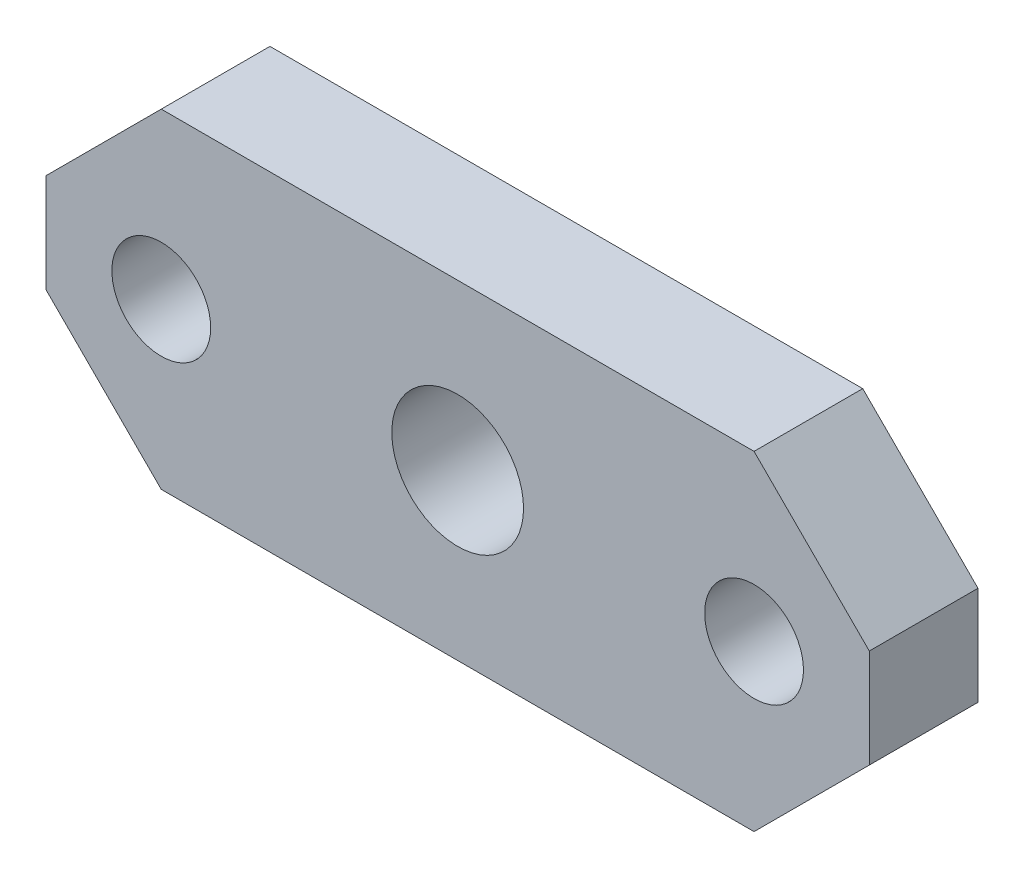
ISO-10303-21;
HEADER;
FILE_DESCRIPTION(('STEP AP214'),'2;1');
FILE_NAME('part.step','',(''),(''),'','','');
FILE_SCHEMA(('AUTOMOTIVE_DESIGN { 1 0 10303 214 1 1 1 1 }'));
ENDSEC;
DATA;
#1=APPLICATION_CONTEXT('core data for automotive mechanical design processes');
#2=APPLICATION_PROTOCOL_DEFINITION('international standard','automotive_design',2000,#1);
#3=PRODUCT_CONTEXT('',#1,'mechanical');
#4=PRODUCT('Part','Part','',(#3));
#5=PRODUCT_RELATED_PRODUCT_CATEGORY('part','',(#4));
#6=PRODUCT_DEFINITION_FORMATION('','',#4);
#7=PRODUCT_DEFINITION_CONTEXT('part definition',#1,'design');
#8=PRODUCT_DEFINITION('design','',#6,#7);
#9=PRODUCT_DEFINITION_SHAPE('','',#8);
#10=(LENGTH_UNIT() NAMED_UNIT(*) SI_UNIT(.MILLI.,.METRE.));
#11=(NAMED_UNIT(*) PLANE_ANGLE_UNIT() SI_UNIT($,.RADIAN.));
#12=(NAMED_UNIT(*) SI_UNIT($,.STERADIAN.) SOLID_ANGLE_UNIT());
#13=UNCERTAINTY_MEASURE_WITH_UNIT(LENGTH_MEASURE(1.E-05),#10,'distance_accuracy_value','');
#14=(GEOMETRIC_REPRESENTATION_CONTEXT(3) GLOBAL_UNCERTAINTY_ASSIGNED_CONTEXT((#13)) GLOBAL_UNIT_ASSIGNED_CONTEXT((#10,
#11,#12)) REPRESENTATION_CONTEXT('',''));
#15=CARTESIAN_POINT('',(0.,0.,0.));
#16=DIRECTION('',(0.,0.,1.));
#17=DIRECTION('',(1.,0.,0.));
#18=AXIS2_PLACEMENT_3D('',#15,#16,#17);
#19=CARTESIAN_POINT('',(-110.241709153107,51.8601507524032,33.));
#20=DIRECTION('',(1.,0.,0.));
#21=DIRECTION('',(0.,1.,0.));
#22=AXIS2_PLACEMENT_3D('',#19,#20,#21);
#23=PLANE('',#22);
#24=DIRECTION('',(0.,-1.,0.));
#25=VECTOR('',#24,1.);
#26=CARTESIAN_POINT('',(-110.241709153107,51.8601507524032,33.));
#27=LINE('',#26,#25);
#28=CARTESIAN_POINT('',(-110.241709153107,16.8601507524033,33.));
#29=VERTEX_POINT('',#28);
#30=CARTESIAN_POINT('',(-110.241709153107,-13.1398492475967,33.));
#31=VERTEX_POINT('',#30);
#32=EDGE_CURVE('E137',#29,#31,#27,.T.);
#33=ORIENTED_EDGE('',*,*,#32,.F.);
#34=DIRECTION('',(0.,0.,-1.));
#35=VECTOR('',#34,1.);
#36=CARTESIAN_POINT('',(-110.241709153107,16.8601507524033,0.));
#37=LINE('',#36,#35);
#38=CARTESIAN_POINT('',(-110.241709153107,16.8601507524033,0.));
#39=VERTEX_POINT('',#38);
#40=EDGE_CURVE('E11',#29,#39,#37,.T.);
#41=ORIENTED_EDGE('',*,*,#40,.T.);
#42=DIRECTION('',(0.,-1.,0.));
#43=VECTOR('',#42,1.);
#44=CARTESIAN_POINT('',(-110.241709153107,51.8601507524032,0.));
#45=LINE('',#44,#43);
#46=CARTESIAN_POINT('',(-110.241709153107,-13.1398492475967,0.));
#47=VERTEX_POINT('',#46);
#48=EDGE_CURVE('E120',#39,#47,#45,.T.);
#49=ORIENTED_EDGE('',*,*,#48,.T.);
#50=DIRECTION('',(0.,0.,1.));
#51=VECTOR('',#50,1.);
#52=CARTESIAN_POINT('',(-110.241709153107,-13.1398492475967,33.));
#53=LINE('',#52,#51);
#54=EDGE_CURVE('E56',#47,#31,#53,.T.);
#55=ORIENTED_EDGE('',*,*,#54,.T.);
#56=EDGE_LOOP('',(#33,#41,#49,#55));
#57=FACE_BOUND('',#56,.T.);
#58=ADVANCED_FACE('F45',(#57),#23,.F.);
#59=CARTESIAN_POINT('',(-110.241709153107,-48.1398492475968,33.));
#60=DIRECTION('',(0.,1.,0.));
#61=DIRECTION('',(0.,0.,1.));
#62=AXIS2_PLACEMENT_3D('',#59,#60,#61);
#63=PLANE('',#62);
#64=DIRECTION('',(1.,0.,0.));
#65=VECTOR('',#64,1.);
#66=CARTESIAN_POINT('',(-110.241709153107,-48.1398492475968,0.));
#67=LINE('',#66,#65);
#68=CARTESIAN_POINT('',(-75.2417091531069,-48.1398492475968,0.));
#69=VERTEX_POINT('',#68);
#70=CARTESIAN_POINT('',(104.758290846893,-48.1398492475968,0.));
#71=VERTEX_POINT('',#70);
#72=EDGE_CURVE('E196',#69,#71,#67,.T.);
#73=ORIENTED_EDGE('',*,*,#72,.T.);
#74=DIRECTION('',(0.,0.,1.));
#75=VECTOR('',#74,1.);
#76=CARTESIAN_POINT('',(104.758290846893,-48.1398492475968,33.));
#77=LINE('',#76,#75);
#78=CARTESIAN_POINT('',(104.758290846893,-48.1398492475968,33.));
#79=VERTEX_POINT('',#78);
#80=EDGE_CURVE('E63',#71,#79,#77,.T.);
#81=ORIENTED_EDGE('',*,*,#80,.T.);
#82=DIRECTION('',(1.,0.,0.));
#83=VECTOR('',#82,1.);
#84=CARTESIAN_POINT('',(-110.241709153107,-48.1398492475968,33.));
#85=LINE('',#84,#83);
#86=CARTESIAN_POINT('',(-75.2417091531069,-48.1398492475968,33.));
#87=VERTEX_POINT('',#86);
#88=EDGE_CURVE('E191',#87,#79,#85,.T.);
#89=ORIENTED_EDGE('',*,*,#88,.F.);
#90=DIRECTION('',(0.,0.,-1.));
#91=VECTOR('',#90,1.);
#92=CARTESIAN_POINT('',(-75.2417091531069,-48.1398492475968,33.));
#93=LINE('',#92,#91);
#94=EDGE_CURVE('E177',#87,#69,#93,.T.);
#95=ORIENTED_EDGE('',*,*,#94,.T.);
#96=EDGE_LOOP('',(#73,#81,#89,#95));
#97=FACE_BOUND('',#96,.T.);
#98=ADVANCED_FACE('F195',(#97),#63,.F.);
#99=CARTESIAN_POINT('',(139.758290846893,51.8601507524032,33.));
#100=DIRECTION('',(1.,0.,0.));
#101=DIRECTION('',(0.,0.,-1.));
#102=AXIS2_PLACEMENT_3D('',#99,#100,#101);
#103=PLANE('',#102);
#104=DIRECTION('',(0.,-1.,0.));
#105=VECTOR('',#104,1.);
#106=CARTESIAN_POINT('',(139.758290846893,51.8601507524032,0.));
#107=LINE('',#106,#105);
#108=CARTESIAN_POINT('',(139.758290846893,16.8601507524031,0.));
#109=VERTEX_POINT('',#108);
#110=CARTESIAN_POINT('',(139.758290846893,-13.1398492475968,0.));
#111=VERTEX_POINT('',#110);
#112=EDGE_CURVE('E138',#109,#111,#107,.T.);
#113=ORIENTED_EDGE('',*,*,#112,.F.);
#114=DIRECTION('',(0.,0.,1.));
#115=VECTOR('',#114,1.);
#116=CARTESIAN_POINT('',(139.758290846893,16.8601507524031,33.));
#117=LINE('',#116,#115);
#118=CARTESIAN_POINT('',(139.758290846893,16.8601507524031,33.));
#119=VERTEX_POINT('',#118);
#120=EDGE_CURVE('E164',#109,#119,#117,.T.);
#121=ORIENTED_EDGE('',*,*,#120,.T.);
#122=DIRECTION('',(0.,-1.,0.));
#123=VECTOR('',#122,1.);
#124=CARTESIAN_POINT('',(139.758290846893,51.8601507524032,33.));
#125=LINE('',#124,#123);
#126=CARTESIAN_POINT('',(139.758290846893,-13.1398492475968,33.));
#127=VERTEX_POINT('',#126);
#128=EDGE_CURVE('E149',#119,#127,#125,.T.);
#129=ORIENTED_EDGE('',*,*,#128,.T.);
#130=DIRECTION('',(0.,0.,-1.));
#131=VECTOR('',#130,1.);
#132=CARTESIAN_POINT('',(139.758290846893,-13.1398492475968,0.));
#133=LINE('',#132,#131);
#134=EDGE_CURVE('E160',#127,#111,#133,.T.);
#135=ORIENTED_EDGE('',*,*,#134,.T.);
#136=EDGE_LOOP('',(#113,#121,#129,#135));
#137=FACE_BOUND('',#136,.T.);
#138=ADVANCED_FACE('F267',(#137),#103,.T.);
#139=CARTESIAN_POINT('',(-110.241709153107,51.8601507524032,33.));
#140=DIRECTION('',(0.,1.,0.));
#141=DIRECTION('',(0.,0.,1.));
#142=AXIS2_PLACEMENT_3D('',#139,#140,#141);
#143=PLANE('',#142);
#144=DIRECTION('',(1.,0.,0.));
#145=VECTOR('',#144,1.);
#146=CARTESIAN_POINT('',(-110.241709153107,51.8601507524032,33.));
#147=LINE('',#146,#145);
#148=CARTESIAN_POINT('',(-75.2417091531068,51.8601507524032,33.));
#149=VERTEX_POINT('',#148);
#150=CARTESIAN_POINT('',(104.758290846893,51.8601507524032,33.));
#151=VERTEX_POINT('',#150);
#152=EDGE_CURVE('E144',#149,#151,#147,.T.);
#153=ORIENTED_EDGE('',*,*,#152,.T.);
#154=DIRECTION('',(0.,0.,-1.));
#155=VECTOR('',#154,1.);
#156=CARTESIAN_POINT('',(104.758290846893,51.8601507524032,33.));
#157=LINE('',#156,#155);
#158=CARTESIAN_POINT('',(104.758290846893,51.8601507524032,0.));
#159=VERTEX_POINT('',#158);
#160=EDGE_CURVE('E135',#151,#159,#157,.T.);
#161=ORIENTED_EDGE('',*,*,#160,.T.);
#162=DIRECTION('',(1.,0.,0.));
#163=VECTOR('',#162,1.);
#164=CARTESIAN_POINT('',(-110.241709153107,51.8601507524032,0.));
#165=LINE('',#164,#163);
#166=CARTESIAN_POINT('',(-75.2417091531068,51.8601507524032,0.));
#167=VERTEX_POINT('',#166);
#168=EDGE_CURVE('E118',#167,#159,#165,.T.);
#169=ORIENTED_EDGE('',*,*,#168,.F.);
#170=DIRECTION('',(0.,0.,1.));
#171=VECTOR('',#170,1.);
#172=CARTESIAN_POINT('',(-75.2417091531068,51.8601507524032,33.));
#173=LINE('',#172,#171);
#174=EDGE_CURVE('E132',#167,#149,#173,.T.);
#175=ORIENTED_EDGE('',*,*,#174,.T.);
#176=EDGE_LOOP('',(#153,#161,#169,#175));
#177=FACE_BOUND('',#176,.T.);
#178=ADVANCED_FACE('F131',(#177),#143,.T.);
#179=CARTESIAN_POINT('',(0.,0.,33.));
#180=DIRECTION('',(0.,0.,1.));
#181=DIRECTION('',(1.,0.,0.));
#182=AXIS2_PLACEMENT_3D('',#179,#180,#181);
#183=PLANE('',#182);
#184=CARTESIAN_POINT('',(-75.2417091531069,1.8601507524032,33.));
#185=DIRECTION('',(0.,0.,1.));
#186=DIRECTION('',(1.,0.,0.));
#187=AXIS2_PLACEMENT_3D('',#184,#185,#186);
#188=CIRCLE('',#187,15.);
#189=CARTESIAN_POINT('',(-60.2417091531069,1.8601507524032,33.));
#190=VERTEX_POINT('',#189);
#191=EDGE_CURVE('E225',#190,#190,#188,.T.);
#192=ORIENTED_EDGE('',*,*,#191,.F.);
#193=EDGE_LOOP('',(#192));
#194=FACE_BOUND('',#193,.T.);
#195=CARTESIAN_POINT('',(104.758290846893,1.8601507524032,33.));
#196=DIRECTION('',(0.,0.,1.));
#197=DIRECTION('',(1.,0.,0.));
#198=AXIS2_PLACEMENT_3D('',#195,#196,#197);
#199=CIRCLE('',#198,15.);
#200=CARTESIAN_POINT('',(119.758290846893,1.8601507524032,33.));
#201=VERTEX_POINT('',#200);
#202=EDGE_CURVE('E217',#201,#201,#199,.T.);
#203=ORIENTED_EDGE('',*,*,#202,.F.);
#204=EDGE_LOOP('',(#203));
#205=FACE_BOUND('',#204,.T.);
#206=CARTESIAN_POINT('',(14.7582908468931,1.8601507524032,33.));
#207=DIRECTION('',(0.,0.,1.));
#208=DIRECTION('',(1.,0.,0.));
#209=AXIS2_PLACEMENT_3D('',#206,#207,#208);
#210=CIRCLE('',#209,20.);
#211=CARTESIAN_POINT('',(34.7582908468931,1.8601507524032,33.));
#212=VERTEX_POINT('',#211);
#213=EDGE_CURVE('E209',#212,#212,#210,.T.);
#214=ORIENTED_EDGE('',*,*,#213,.F.);
#215=EDGE_LOOP('',(#214));
#216=FACE_BOUND('',#215,.T.);
#217=ORIENTED_EDGE('',*,*,#128,.F.);
#218=DIRECTION('',(0.707106781186547,-0.707106781186548,0.));
#219=VECTOR('',#218,1.);
#220=CARTESIAN_POINT('',(78.3092207996483,78.3092207996481,33.));
#221=LINE('',#220,#219);
#222=EDGE_CURVE('E174',#119,#151,#221,.F.);
#223=ORIENTED_EDGE('',*,*,#222,.T.);
#224=ORIENTED_EDGE('',*,*,#152,.F.);
#225=DIRECTION('',(-0.707106781186549,-0.707106781186546,0.));
#226=VECTOR('',#225,1.);
#227=CARTESIAN_POINT('',(-63.5509299527549,63.5509299527551,33.));
#228=LINE('',#227,#226);
#229=EDGE_CURVE('E142',#149,#29,#228,.T.);
#230=ORIENTED_EDGE('',*,*,#229,.T.);
#231=ORIENTED_EDGE('',*,*,#32,.T.);
#232=DIRECTION('',(-0.707106781186546,0.707106781186549,0.));
#233=VECTOR('',#232,1.);
#234=CARTESIAN_POINT('',(-61.6907792003519,-61.6907792003517,33.));
#235=LINE('',#234,#233);
#236=EDGE_CURVE('E70',#31,#87,#235,.F.);
#237=ORIENTED_EDGE('',*,*,#236,.T.);
#238=ORIENTED_EDGE('',*,*,#88,.T.);
#239=DIRECTION('',(0.707106781186549,0.707106781186546,0.));
#240=VECTOR('',#239,1.);
#241=CARTESIAN_POINT('',(76.4490700472447,-76.449070047245,33.));
#242=LINE('',#241,#240);
#243=EDGE_CURVE('E171',#79,#127,#242,.T.);
#244=ORIENTED_EDGE('',*,*,#243,.T.);
#245=EDGE_LOOP('',(#217,#223,#224,#230,#231,#237,#238,#244));
#246=FACE_BOUND('',#245,.T.);
#247=ADVANCED_FACE('F189',(#194,#205,#216,#246),#183,.T.);
#248=CARTESIAN_POINT('',(0.,0.,0.));
#249=DIRECTION('',(0.,0.,1.));
#250=DIRECTION('',(1.,0.,0.));
#251=AXIS2_PLACEMENT_3D('',#248,#249,#250);
#252=PLANE('',#251);
#253=CARTESIAN_POINT('',(-75.2417091531069,1.8601507524032,0.));
#254=DIRECTION('',(0.,0.,1.));
#255=DIRECTION('',(1.,0.,0.));
#256=AXIS2_PLACEMENT_3D('',#253,#254,#255);
#257=CIRCLE('',#256,15.);
#258=CARTESIAN_POINT('',(-60.2417091531069,1.8601507524032,0.));
#259=VERTEX_POINT('',#258);
#260=EDGE_CURVE('E221',#259,#259,#257,.F.);
#261=ORIENTED_EDGE('',*,*,#260,.F.);
#262=EDGE_LOOP('',(#261));
#263=FACE_BOUND('',#262,.T.);
#264=CARTESIAN_POINT('',(104.758290846893,1.8601507524032,0.));
#265=DIRECTION('',(0.,0.,1.));
#266=DIRECTION('',(1.,0.,0.));
#267=AXIS2_PLACEMENT_3D('',#264,#265,#266);
#268=CIRCLE('',#267,15.);
#269=CARTESIAN_POINT('',(119.758290846893,1.8601507524032,0.));
#270=VERTEX_POINT('',#269);
#271=EDGE_CURVE('E213',#270,#270,#268,.F.);
#272=ORIENTED_EDGE('',*,*,#271,.F.);
#273=EDGE_LOOP('',(#272));
#274=FACE_BOUND('',#273,.T.);
#275=CARTESIAN_POINT('',(14.7582908468931,1.8601507524032,0.));
#276=DIRECTION('',(0.,0.,1.));
#277=DIRECTION('',(1.,0.,0.));
#278=AXIS2_PLACEMENT_3D('',#275,#276,#277);
#279=CIRCLE('',#278,20.);
#280=CARTESIAN_POINT('',(34.7582908468931,1.8601507524032,0.));
#281=VERTEX_POINT('',#280);
#282=EDGE_CURVE('E50',#281,#281,#279,.T.);
#283=ORIENTED_EDGE('',*,*,#282,.T.);
#284=EDGE_LOOP('',(#283));
#285=FACE_BOUND('',#284,.T.);
#286=ORIENTED_EDGE('',*,*,#168,.T.);
#287=DIRECTION('',(-0.707106781186547,0.707106781186548,0.));
#288=VECTOR('',#287,1.);
#289=CARTESIAN_POINT('',(104.758290846893,51.8601507524032,0.));
#290=LINE('',#289,#288);
#291=EDGE_CURVE('E157',#159,#109,#290,.F.);
#292=ORIENTED_EDGE('',*,*,#291,.T.);
#293=ORIENTED_EDGE('',*,*,#112,.T.);
#294=DIRECTION('',(-0.707106781186549,-0.707106781186546,0.));
#295=VECTOR('',#294,1.);
#296=CARTESIAN_POINT('',(139.758290846893,-13.1398492475968,0.));
#297=LINE('',#296,#295);
#298=EDGE_CURVE('E125',#111,#71,#297,.T.);
#299=ORIENTED_EDGE('',*,*,#298,.T.);
#300=ORIENTED_EDGE('',*,*,#72,.F.);
#301=DIRECTION('',(0.707106781186546,-0.707106781186549,0.));
#302=VECTOR('',#301,1.);
#303=CARTESIAN_POINT('',(-75.2417091531069,-48.1398492475968,0.));
#304=LINE('',#303,#302);
#305=EDGE_CURVE('E126',#69,#47,#304,.F.);
#306=ORIENTED_EDGE('',*,*,#305,.T.);
#307=ORIENTED_EDGE('',*,*,#48,.F.);
#308=DIRECTION('',(0.707106781186549,0.707106781186546,0.));
#309=VECTOR('',#308,1.);
#310=CARTESIAN_POINT('',(-110.241709153107,16.8601507524033,0.));
#311=LINE('',#310,#309);
#312=EDGE_CURVE('E115',#39,#167,#311,.T.);
#313=ORIENTED_EDGE('',*,*,#312,.T.);
#314=EDGE_LOOP('',(#286,#292,#293,#299,#300,#306,#307,#313));
#315=FACE_BOUND('',#314,.T.);
#316=ADVANCED_FACE('F117',(#263,#274,#285,#315),#252,.F.);
#317=CARTESIAN_POINT('',(104.758290846893,51.8601507524032,33.));
#318=DIRECTION('',(-0.707106781186548,-0.707106781186547,0.));
#319=DIRECTION('',(0.,0.,-1.));
#320=AXIS2_PLACEMENT_3D('',#317,#318,#319);
#321=PLANE('',#320);
#322=ORIENTED_EDGE('',*,*,#222,.F.);
#323=ORIENTED_EDGE('',*,*,#120,.F.);
#324=ORIENTED_EDGE('',*,*,#291,.F.);
#325=ORIENTED_EDGE('',*,*,#160,.F.);
#326=EDGE_LOOP('',(#322,#323,#324,#325));
#327=FACE_BOUND('',#326,.T.);
#328=ADVANCED_FACE('F250',(#327),#321,.F.);
#329=CARTESIAN_POINT('',(139.758290846893,-13.1398492475968,33.));
#330=DIRECTION('',(0.707106781186546,-0.707106781186549,0.));
#331=DIRECTION('',(0.,0.,1.));
#332=AXIS2_PLACEMENT_3D('',#329,#330,#331);
#333=PLANE('',#332);
#334=ORIENTED_EDGE('',*,*,#243,.F.);
#335=ORIENTED_EDGE('',*,*,#80,.F.);
#336=ORIENTED_EDGE('',*,*,#298,.F.);
#337=ORIENTED_EDGE('',*,*,#134,.F.);
#338=EDGE_LOOP('',(#334,#335,#336,#337));
#339=FACE_BOUND('',#338,.T.);
#340=ADVANCED_FACE('F256',(#339),#333,.T.);
#341=CARTESIAN_POINT('',(-110.241709153107,16.8601507524033,33.));
#342=DIRECTION('',(-0.707106781186546,0.707106781186549,0.));
#343=DIRECTION('',(0.,0.,1.));
#344=AXIS2_PLACEMENT_3D('',#341,#342,#343);
#345=PLANE('',#344);
#346=ORIENTED_EDGE('',*,*,#229,.F.);
#347=ORIENTED_EDGE('',*,*,#174,.F.);
#348=ORIENTED_EDGE('',*,*,#312,.F.);
#349=ORIENTED_EDGE('',*,*,#40,.F.);
#350=EDGE_LOOP('',(#346,#347,#348,#349));
#351=FACE_BOUND('',#350,.T.);
#352=ADVANCED_FACE('F141',(#351),#345,.T.);
#353=CARTESIAN_POINT('',(-75.2417091531069,-48.1398492475968,33.));
#354=DIRECTION('',(0.707106781186549,0.707106781186546,0.));
#355=DIRECTION('',(0.,0.,-1.));
#356=AXIS2_PLACEMENT_3D('',#353,#354,#355);
#357=PLANE('',#356);
#358=ORIENTED_EDGE('',*,*,#236,.F.);
#359=ORIENTED_EDGE('',*,*,#54,.F.);
#360=ORIENTED_EDGE('',*,*,#305,.F.);
#361=ORIENTED_EDGE('',*,*,#94,.F.);
#362=EDGE_LOOP('',(#358,#359,#360,#361));
#363=FACE_BOUND('',#362,.T.);
#364=ADVANCED_FACE('F48',(#363),#357,.F.);
#365=CARTESIAN_POINT('',(14.7582908468931,1.8601507524032,-2.));
#366=DIRECTION('',(0.,0.,1.));
#367=DIRECTION('',(1.,0.,0.));
#368=AXIS2_PLACEMENT_3D('',#365,#366,#367);
#369=CYLINDRICAL_SURFACE('',#368,20.);
#370=ORIENTED_EDGE('',*,*,#213,.T.);
#371=EDGE_LOOP('',(#370));
#372=FACE_BOUND('',#371,.T.);
#373=ORIENTED_EDGE('',*,*,#282,.F.);
#374=EDGE_LOOP('',(#373));
#375=FACE_BOUND('',#374,.T.);
#376=ADVANCED_FACE('F240',(#372,#375),#369,.F.);
#377=CARTESIAN_POINT('',(104.758290846893,1.8601507524032,-0.001000000000001));
#378=DIRECTION('',(0.,0.,1.));
#379=DIRECTION('',(1.,0.,0.));
#380=AXIS2_PLACEMENT_3D('',#377,#378,#379);
#381=CYLINDRICAL_SURFACE('',#380,15.);
#382=ORIENTED_EDGE('',*,*,#202,.T.);
#383=EDGE_LOOP('',(#382));
#384=FACE_BOUND('',#383,.T.);
#385=ORIENTED_EDGE('',*,*,#271,.T.);
#386=EDGE_LOOP('',(#385));
#387=FACE_BOUND('',#386,.T.);
#388=ADVANCED_FACE('F243',(#384,#387),#381,.F.);
#389=CARTESIAN_POINT('',(-75.2417091531069,1.8601507524032,-0.001000000000001));
#390=DIRECTION('',(0.,0.,1.));
#391=DIRECTION('',(1.,0.,0.));
#392=AXIS2_PLACEMENT_3D('',#389,#390,#391);
#393=CYLINDRICAL_SURFACE('',#392,15.);
#394=ORIENTED_EDGE('',*,*,#191,.T.);
#395=EDGE_LOOP('',(#394));
#396=FACE_BOUND('',#395,.T.);
#397=ORIENTED_EDGE('',*,*,#260,.T.);
#398=EDGE_LOOP('',(#397));
#399=FACE_BOUND('',#398,.T.);
#400=ADVANCED_FACE('F230',(#396,#399),#393,.F.);
#401=CLOSED_SHELL('',(#58,#98,#138,#178,#247,#316,#328,#340,#352,#364,#376,#388,#400));
#402=MANIFOLD_SOLID_BREP('B2',#401);
#403=ADVANCED_BREP_SHAPE_REPRESENTATION('',(#18,#402),#14);
#404=SHAPE_DEFINITION_REPRESENTATION(#9,#403);
ENDSEC;
END-ISO-10303-21;
